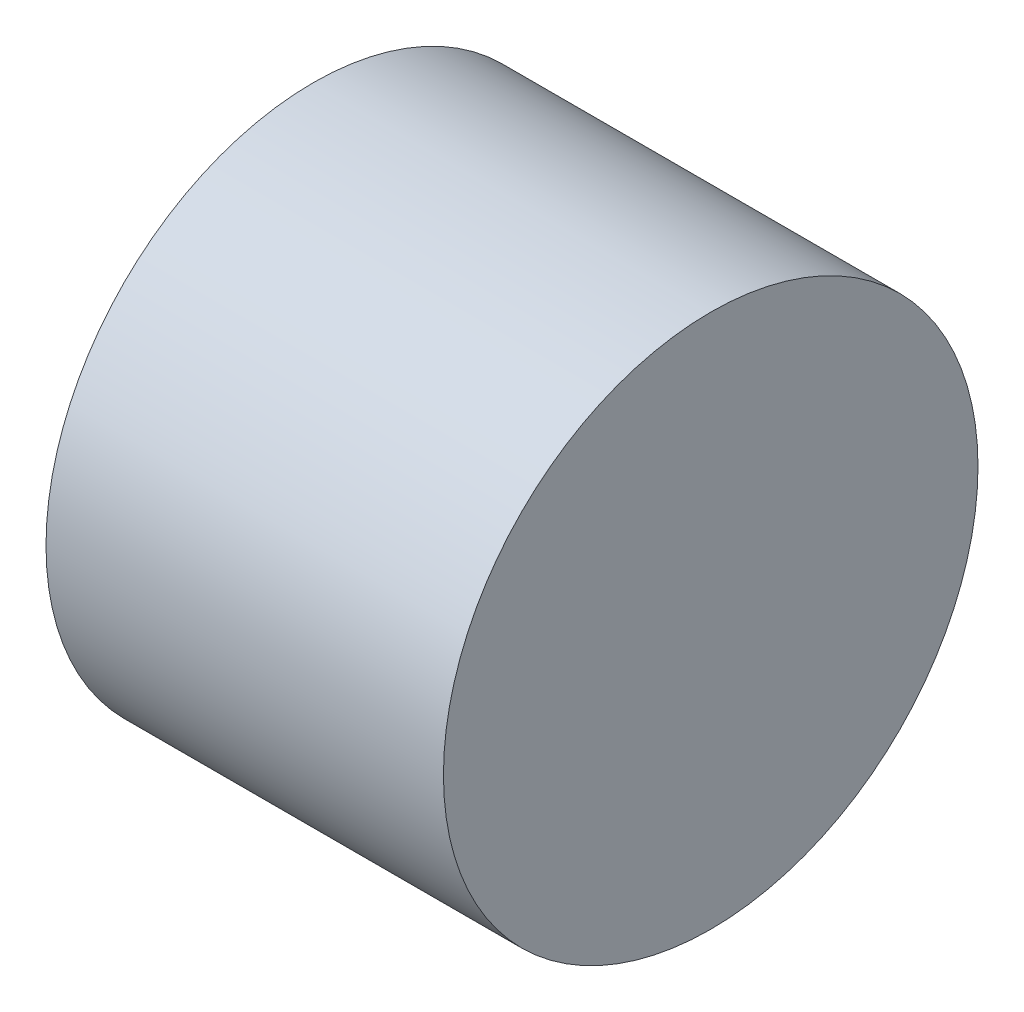
ISO-10303-21;
HEADER;
FILE_DESCRIPTION(('STEP AP214'),'2;1');
FILE_NAME('part.step','',(''),(''),'','','');
FILE_SCHEMA(('AUTOMOTIVE_DESIGN { 1 0 10303 214 1 1 1 1 }'));
ENDSEC;
DATA;
#1=APPLICATION_CONTEXT('core data for automotive mechanical design processes');
#2=APPLICATION_PROTOCOL_DEFINITION('international standard','automotive_design',2000,#1);
#3=PRODUCT_CONTEXT('',#1,'mechanical');
#4=PRODUCT('Part','Part','',(#3));
#5=PRODUCT_RELATED_PRODUCT_CATEGORY('part','',(#4));
#6=PRODUCT_DEFINITION_FORMATION('','',#4);
#7=PRODUCT_DEFINITION_CONTEXT('part definition',#1,'design');
#8=PRODUCT_DEFINITION('design','',#6,#7);
#9=PRODUCT_DEFINITION_SHAPE('','',#8);
#10=(LENGTH_UNIT() NAMED_UNIT(*) SI_UNIT(.MILLI.,.METRE.));
#11=(NAMED_UNIT(*) PLANE_ANGLE_UNIT() SI_UNIT($,.RADIAN.));
#12=(NAMED_UNIT(*) SI_UNIT($,.STERADIAN.) SOLID_ANGLE_UNIT());
#13=UNCERTAINTY_MEASURE_WITH_UNIT(LENGTH_MEASURE(1.E-05),#10,'distance_accuracy_value','');
#14=(GEOMETRIC_REPRESENTATION_CONTEXT(3) GLOBAL_UNCERTAINTY_ASSIGNED_CONTEXT((#13)) GLOBAL_UNIT_ASSIGNED_CONTEXT((#10,
#11,#12)) REPRESENTATION_CONTEXT('',''));
#15=CARTESIAN_POINT('',(0.,0.,0.));
#16=DIRECTION('',(0.,0.,1.));
#17=DIRECTION('',(1.,0.,0.));
#18=AXIS2_PLACEMENT_3D('',#15,#16,#17);
#19=CARTESIAN_POINT('',(-10.,0.,0.));
#20=DIRECTION('',(1.,0.,0.));
#21=DIRECTION('',(0.,0.,-1.));
#22=AXIS2_PLACEMENT_3D('',#19,#20,#21);
#23=CYLINDRICAL_SURFACE('',#22,6.725);
#24=CARTESIAN_POINT('',(-10.,0.,0.));
#25=DIRECTION('',(1.,0.,0.));
#26=DIRECTION('',(0.,0.,-1.));
#27=AXIS2_PLACEMENT_3D('',#24,#25,#26);
#28=CIRCLE('',#27,6.725);
#29=CARTESIAN_POINT('',(-10.,0.,-6.725));
#30=VERTEX_POINT('',#29);
#31=EDGE_CURVE('E10',#30,#30,#28,.T.);
#32=ORIENTED_EDGE('',*,*,#31,.T.);
#33=EDGE_LOOP('',(#32));
#34=FACE_BOUND('',#33,.T.);
#35=CARTESIAN_POINT('',(0.,0.,0.));
#36=DIRECTION('',(1.,0.,0.));
#37=DIRECTION('',(0.,0.,-1.));
#38=AXIS2_PLACEMENT_3D('',#35,#36,#37);
#39=CIRCLE('',#38,6.725);
#40=CARTESIAN_POINT('',(0.,0.,-6.725));
#41=VERTEX_POINT('',#40);
#42=EDGE_CURVE('E36',#41,#41,#39,.T.);
#43=ORIENTED_EDGE('',*,*,#42,.F.);
#44=EDGE_LOOP('',(#43));
#45=FACE_BOUND('',#44,.T.);
#46=ADVANCED_FACE('F33',(#34,#45),#23,.T.);
#47=CARTESIAN_POINT('',(-10.,0.,0.));
#48=DIRECTION('',(1.,0.,0.));
#49=DIRECTION('',(0.,0.,-1.));
#50=AXIS2_PLACEMENT_3D('',#47,#48,#49);
#51=PLANE('',#50);
#52=ORIENTED_EDGE('',*,*,#31,.F.);
#53=EDGE_LOOP('',(#52));
#54=FACE_BOUND('',#53,.T.);
#55=ADVANCED_FACE('F48',(#54),#51,.F.);
#56=CARTESIAN_POINT('',(0.,0.,0.));
#57=DIRECTION('',(1.,0.,0.));
#58=DIRECTION('',(0.,0.,-1.));
#59=AXIS2_PLACEMENT_3D('',#56,#57,#58);
#60=PLANE('',#59);
#61=ORIENTED_EDGE('',*,*,#42,.T.);
#62=EDGE_LOOP('',(#61));
#63=FACE_BOUND('',#62,.T.);
#64=ADVANCED_FACE('F45',(#63),#60,.T.);
#65=CLOSED_SHELL('',(#46,#55,#64));
#66=MANIFOLD_SOLID_BREP('B2',#65);
#67=ADVANCED_BREP_SHAPE_REPRESENTATION('',(#18,#66),#14);
#68=SHAPE_DEFINITION_REPRESENTATION(#9,#67);
ENDSEC;
END-ISO-10303-21;
